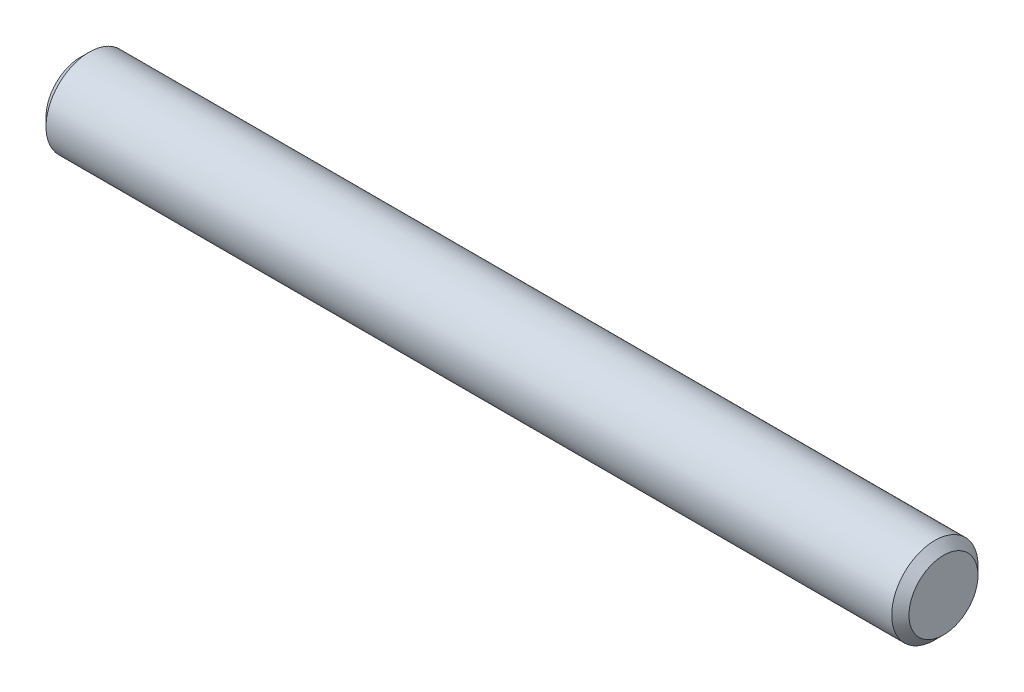
ISO-10303-21;
HEADER;
FILE_DESCRIPTION(('STEP AP214'),'2;1');
FILE_NAME('part.step','',(''),(''),'','','');
FILE_SCHEMA(('AUTOMOTIVE_DESIGN { 1 0 10303 214 1 1 1 1 }'));
ENDSEC;
DATA;
#1=APPLICATION_CONTEXT('core data for automotive mechanical design processes');
#2=APPLICATION_PROTOCOL_DEFINITION('international standard','automotive_design',2000,#1);
#3=PRODUCT_CONTEXT('',#1,'mechanical');
#4=PRODUCT('Part','Part','',(#3));
#5=PRODUCT_RELATED_PRODUCT_CATEGORY('part','',(#4));
#6=PRODUCT_DEFINITION_FORMATION('','',#4);
#7=PRODUCT_DEFINITION_CONTEXT('part definition',#1,'design');
#8=PRODUCT_DEFINITION('design','',#6,#7);
#9=PRODUCT_DEFINITION_SHAPE('','',#8);
#10=(LENGTH_UNIT() NAMED_UNIT(*) SI_UNIT(.MILLI.,.METRE.));
#11=(NAMED_UNIT(*) PLANE_ANGLE_UNIT() SI_UNIT($,.RADIAN.));
#12=(NAMED_UNIT(*) SI_UNIT($,.STERADIAN.) SOLID_ANGLE_UNIT());
#13=UNCERTAINTY_MEASURE_WITH_UNIT(LENGTH_MEASURE(1.E-05),#10,'distance_accuracy_value','');
#14=(GEOMETRIC_REPRESENTATION_CONTEXT(3) GLOBAL_UNCERTAINTY_ASSIGNED_CONTEXT((#13)) GLOBAL_UNIT_ASSIGNED_CONTEXT((#10,
#11,#12)) REPRESENTATION_CONTEXT('',''));
#15=CARTESIAN_POINT('',(0.,0.,0.));
#16=DIRECTION('',(0.,0.,1.));
#17=DIRECTION('',(1.,0.,0.));
#18=AXIS2_PLACEMENT_3D('',#15,#16,#17);
#19=CARTESIAN_POINT('',(-15.875,0.,0.));
#20=DIRECTION('',(1.,0.,0.));
#21=DIRECTION('',(0.,0.,-1.));
#22=AXIS2_PLACEMENT_3D('',#19,#20,#21);
#23=CYLINDRICAL_SURFACE('',#22,1.5875);
#24=CARTESIAN_POINT('',(15.5575,0.,0.));
#25=DIRECTION('',(1.,0.,0.));
#26=DIRECTION('',(0.,0.,-1.));
#27=AXIS2_PLACEMENT_3D('',#24,#25,#26);
#28=CIRCLE('',#27,1.5875);
#29=CARTESIAN_POINT('',(15.5575,0.,-1.5875));
#30=VERTEX_POINT('',#29);
#31=EDGE_CURVE('E39',#30,#30,#28,.F.);
#32=ORIENTED_EDGE('',*,*,#31,.T.);
#33=EDGE_LOOP('',(#32));
#34=FACE_BOUND('',#33,.T.);
#35=CARTESIAN_POINT('',(-15.5575,0.,0.));
#36=DIRECTION('',(1.,0.,0.));
#37=DIRECTION('',(0.,0.,-1.));
#38=AXIS2_PLACEMENT_3D('',#35,#36,#37);
#39=CIRCLE('',#38,1.5875);
#40=CARTESIAN_POINT('',(-15.5575,0.,-1.5875));
#41=VERTEX_POINT('',#40);
#42=EDGE_CURVE('E43',#41,#41,#39,.T.);
#43=ORIENTED_EDGE('',*,*,#42,.T.);
#44=EDGE_LOOP('',(#43));
#45=FACE_BOUND('',#44,.T.);
#46=ADVANCED_FACE('F32',(#34,#45),#23,.T.);
#47=CARTESIAN_POINT('',(-15.875,0.,0.));
#48=DIRECTION('',(1.,0.,0.));
#49=DIRECTION('',(0.,0.,-1.));
#50=AXIS2_PLACEMENT_3D('',#47,#48,#49);
#51=PLANE('',#50);
#52=CARTESIAN_POINT('',(-15.875,0.,0.));
#53=DIRECTION('',(1.,0.,0.));
#54=DIRECTION('',(0.,0.,-1.));
#55=AXIS2_PLACEMENT_3D('',#52,#53,#54);
#56=CIRCLE('',#55,1.27);
#57=CARTESIAN_POINT('',(-15.875,0.,-1.27));
#58=VERTEX_POINT('',#57);
#59=EDGE_CURVE('E10',#58,#58,#56,.F.);
#60=ORIENTED_EDGE('',*,*,#59,.T.);
#61=EDGE_LOOP('',(#60));
#62=FACE_BOUND('',#61,.T.);
#63=ADVANCED_FACE('F63',(#62),#51,.F.);
#64=CARTESIAN_POINT('',(15.875,0.,0.));
#65=DIRECTION('',(1.,0.,0.));
#66=DIRECTION('',(0.,0.,-1.));
#67=AXIS2_PLACEMENT_3D('',#64,#65,#66);
#68=PLANE('',#67);
#69=CARTESIAN_POINT('',(15.875,0.,0.));
#70=DIRECTION('',(1.,0.,0.));
#71=DIRECTION('',(0.,0.,-1.));
#72=AXIS2_PLACEMENT_3D('',#69,#70,#71);
#73=CIRCLE('',#72,1.27);
#74=CARTESIAN_POINT('',(15.875,0.,-1.27));
#75=VERTEX_POINT('',#74);
#76=EDGE_CURVE('E47',#75,#75,#73,.T.);
#77=ORIENTED_EDGE('',*,*,#76,.T.);
#78=EDGE_LOOP('',(#77));
#79=FACE_BOUND('',#78,.T.);
#80=ADVANCED_FACE('F53',(#79),#68,.T.);
#81=CARTESIAN_POINT('',(15.875,0.,0.));
#82=DIRECTION('',(-1.,0.,0.));
#83=DIRECTION('',(0.,0.,1.));
#84=AXIS2_PLACEMENT_3D('',#81,#82,#83);
#85=CONICAL_SURFACE('',#84,1.27,0.785398163397445);
#86=ORIENTED_EDGE('',*,*,#31,.F.);
#87=EDGE_LOOP('',(#86));
#88=FACE_BOUND('',#87,.T.);
#89=ORIENTED_EDGE('',*,*,#76,.F.);
#90=EDGE_LOOP('',(#89));
#91=FACE_BOUND('',#90,.T.);
#92=ADVANCED_FACE('F55',(#88,#91),#85,.T.);
#93=CARTESIAN_POINT('',(-15.5575,0.,0.));
#94=DIRECTION('',(1.,0.,0.));
#95=DIRECTION('',(0.,0.,-1.));
#96=AXIS2_PLACEMENT_3D('',#93,#94,#95);
#97=CONICAL_SURFACE('',#96,1.5875,0.78539816339745);
#98=ORIENTED_EDGE('',*,*,#59,.F.);
#99=EDGE_LOOP('',(#98));
#100=FACE_BOUND('',#99,.T.);
#101=ORIENTED_EDGE('',*,*,#42,.F.);
#102=EDGE_LOOP('',(#101));
#103=FACE_BOUND('',#102,.T.);
#104=ADVANCED_FACE('F34',(#100,#103),#97,.T.);
#105=CLOSED_SHELL('',(#46,#63,#80,#92,#104));
#106=MANIFOLD_SOLID_BREP('B2',#105);
#107=ADVANCED_BREP_SHAPE_REPRESENTATION('',(#18,#106),#14);
#108=SHAPE_DEFINITION_REPRESENTATION(#9,#107);
ENDSEC;
END-ISO-10303-21;
